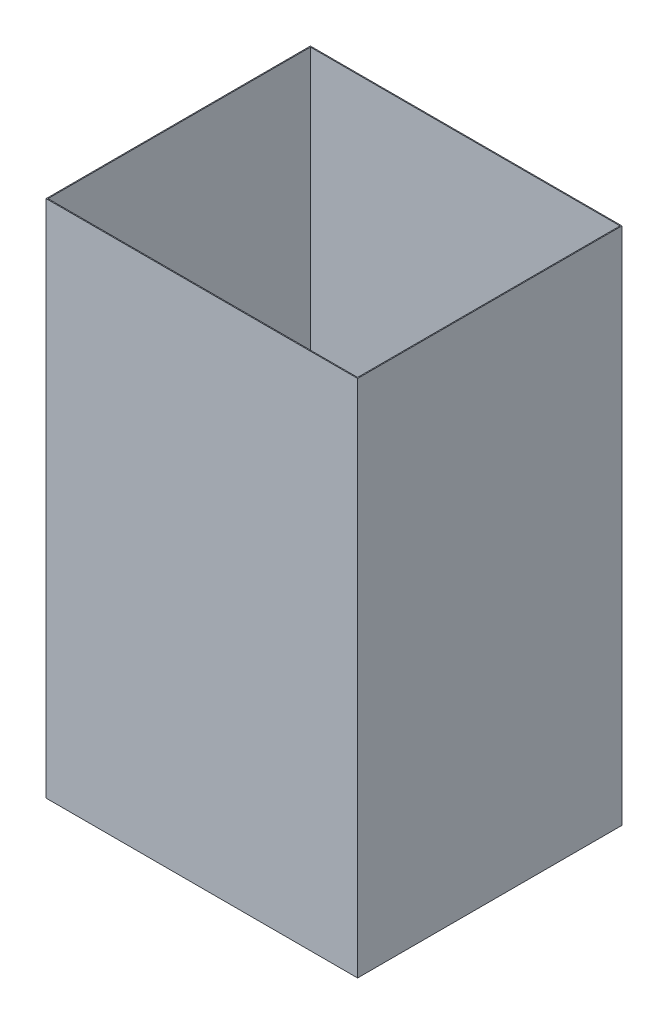
ISO-10303-21;
HEADER;
FILE_DESCRIPTION(('STEP AP214'),'2;1');
FILE_NAME('part.step','',(''),(''),'','','');
FILE_SCHEMA(('AUTOMOTIVE_DESIGN { 1 0 10303 214 1 1 1 1 }'));
ENDSEC;
DATA;
#1=APPLICATION_CONTEXT('core data for automotive mechanical design processes');
#2=APPLICATION_PROTOCOL_DEFINITION('international standard','automotive_design',2000,#1);
#3=PRODUCT_CONTEXT('',#1,'mechanical');
#4=PRODUCT('Part','Part','',(#3));
#5=PRODUCT_RELATED_PRODUCT_CATEGORY('part','',(#4));
#6=PRODUCT_DEFINITION_FORMATION('','',#4);
#7=PRODUCT_DEFINITION_CONTEXT('part definition',#1,'design');
#8=PRODUCT_DEFINITION('design','',#6,#7);
#9=PRODUCT_DEFINITION_SHAPE('','',#8);
#10=(LENGTH_UNIT() NAMED_UNIT(*) SI_UNIT(.MILLI.,.METRE.));
#11=(NAMED_UNIT(*) PLANE_ANGLE_UNIT() SI_UNIT($,.RADIAN.));
#12=(NAMED_UNIT(*) SI_UNIT($,.STERADIAN.) SOLID_ANGLE_UNIT());
#13=UNCERTAINTY_MEASURE_WITH_UNIT(LENGTH_MEASURE(1.E-05),#10,'distance_accuracy_value','');
#14=(GEOMETRIC_REPRESENTATION_CONTEXT(3) GLOBAL_UNCERTAINTY_ASSIGNED_CONTEXT((#13)) GLOBAL_UNIT_ASSIGNED_CONTEXT((#10,
#11,#12)) REPRESENTATION_CONTEXT('',''));
#15=CARTESIAN_POINT('',(0.,0.,0.));
#16=DIRECTION('',(0.,0.,1.));
#17=DIRECTION('',(1.,0.,0.));
#18=AXIS2_PLACEMENT_3D('',#15,#16,#17);
#19=CARTESIAN_POINT('',(0.,0.,0.));
#20=DIRECTION('',(0.,-1.,0.));
#21=DIRECTION('',(0.,0.,-1.));
#22=AXIS2_PLACEMENT_3D('',#19,#20,#21);
#23=PLANE('',#22);
#24=DIRECTION('',(0.,0.,1.));
#25=VECTOR('',#24,1.);
#26=CARTESIAN_POINT('',(0.,0.,0.));
#27=LINE('',#26,#25);
#28=CARTESIAN_POINT('',(0.,0.,-711.2));
#29=VERTEX_POINT('',#28);
#30=CARTESIAN_POINT('',(0.,0.,0.));
#31=VERTEX_POINT('',#30);
#32=EDGE_CURVE('E107',#29,#31,#27,.T.);
#33=ORIENTED_EDGE('',*,*,#32,.F.);
#34=DIRECTION('',(-1.,0.,0.));
#35=VECTOR('',#34,1.);
#36=CARTESIAN_POINT('',(0.,0.,-711.2));
#37=LINE('',#36,#35);
#38=CARTESIAN_POINT('',(838.2,0.,-711.2));
#39=VERTEX_POINT('',#38);
#40=EDGE_CURVE('E140',#39,#29,#37,.T.);
#41=ORIENTED_EDGE('',*,*,#40,.F.);
#42=DIRECTION('',(0.,0.,-1.));
#43=VECTOR('',#42,1.);
#44=CARTESIAN_POINT('',(838.2,0.,0.));
#45=LINE('',#44,#43);
#46=CARTESIAN_POINT('',(838.2,0.,0.));
#47=VERTEX_POINT('',#46);
#48=EDGE_CURVE('E151',#47,#39,#45,.T.);
#49=ORIENTED_EDGE('',*,*,#48,.F.);
#50=DIRECTION('',(1.,0.,0.));
#51=VECTOR('',#50,1.);
#52=CARTESIAN_POINT('',(0.,0.,0.));
#53=LINE('',#52,#51);
#54=EDGE_CURVE('E149',#31,#47,#53,.T.);
#55=ORIENTED_EDGE('',*,*,#54,.F.);
#56=EDGE_LOOP('',(#33,#41,#49,#55));
#57=FACE_BOUND('',#56,.T.);
#58=DIRECTION('',(-1.,0.,0.));
#59=VECTOR('',#58,1.);
#60=CARTESIAN_POINT('',(0.,0.,-708.66));
#61=LINE('',#60,#59);
#62=CARTESIAN_POINT('',(835.66,0.,-708.66));
#63=VERTEX_POINT('',#62);
#64=CARTESIAN_POINT('',(2.54,0.,-708.66));
#65=VERTEX_POINT('',#64);
#66=EDGE_CURVE('E128',#63,#65,#61,.T.);
#67=ORIENTED_EDGE('',*,*,#66,.T.);
#68=DIRECTION('',(0.,0.,1.));
#69=VECTOR('',#68,1.);
#70=CARTESIAN_POINT('',(2.54,0.,0.));
#71=LINE('',#70,#69);
#72=CARTESIAN_POINT('',(2.54,0.,-2.54));
#73=VERTEX_POINT('',#72);
#74=EDGE_CURVE('E115',#65,#73,#71,.T.);
#75=ORIENTED_EDGE('',*,*,#74,.T.);
#76=DIRECTION('',(1.,0.,0.));
#77=VECTOR('',#76,1.);
#78=CARTESIAN_POINT('',(0.,0.,-2.54));
#79=LINE('',#78,#77);
#80=CARTESIAN_POINT('',(835.66,0.,-2.54));
#81=VERTEX_POINT('',#80);
#82=EDGE_CURVE('E105',#73,#81,#79,.T.);
#83=ORIENTED_EDGE('',*,*,#82,.T.);
#84=DIRECTION('',(0.,0.,-1.));
#85=VECTOR('',#84,1.);
#86=CARTESIAN_POINT('',(835.66,0.,0.));
#87=LINE('',#86,#85);
#88=EDGE_CURVE('E56',#81,#63,#87,.T.);
#89=ORIENTED_EDGE('',*,*,#88,.T.);
#90=EDGE_LOOP('',(#67,#75,#83,#89));
#91=FACE_BOUND('',#90,.T.);
#92=ADVANCED_FACE('F33',(#57,#91),#23,.T.);
#93=CARTESIAN_POINT('',(0.,1397.,0.));
#94=DIRECTION('',(1.,0.,0.));
#95=DIRECTION('',(0.,0.,-1.));
#96=AXIS2_PLACEMENT_3D('',#93,#94,#95);
#97=PLANE('',#96);
#98=ORIENTED_EDGE('',*,*,#32,.T.);
#99=DIRECTION('',(0.,-1.,0.));
#100=VECTOR('',#99,1.);
#101=CARTESIAN_POINT('',(0.,1397.,0.));
#102=LINE('',#101,#100);
#103=CARTESIAN_POINT('',(0.,1397.,0.));
#104=VERTEX_POINT('',#103);
#105=EDGE_CURVE('E11',#104,#31,#102,.T.);
#106=ORIENTED_EDGE('',*,*,#105,.F.);
#107=DIRECTION('',(0.,0.,1.));
#108=VECTOR('',#107,1.);
#109=CARTESIAN_POINT('',(0.,1397.,0.));
#110=LINE('',#109,#108);
#111=CARTESIAN_POINT('',(0.,1397.,-711.2));
#112=VERTEX_POINT('',#111);
#113=EDGE_CURVE('E136',#112,#104,#110,.T.);
#114=ORIENTED_EDGE('',*,*,#113,.F.);
#115=DIRECTION('',(0.,-1.,0.));
#116=VECTOR('',#115,1.);
#117=CARTESIAN_POINT('',(0.,1397.,-711.2));
#118=LINE('',#117,#116);
#119=EDGE_CURVE('E146',#112,#29,#118,.T.);
#120=ORIENTED_EDGE('',*,*,#119,.T.);
#121=EDGE_LOOP('',(#98,#106,#114,#120));
#122=FACE_BOUND('',#121,.T.);
#123=ADVANCED_FACE('F35',(#122),#97,.F.);
#124=CARTESIAN_POINT('',(0.,1397.,0.));
#125=DIRECTION('',(0.,0.,-1.));
#126=DIRECTION('',(-1.,0.,0.));
#127=AXIS2_PLACEMENT_3D('',#124,#125,#126);
#128=PLANE('',#127);
#129=ORIENTED_EDGE('',*,*,#54,.T.);
#130=DIRECTION('',(0.,-1.,0.));
#131=VECTOR('',#130,1.);
#132=CARTESIAN_POINT('',(838.2,1397.,0.));
#133=LINE('',#132,#131);
#134=CARTESIAN_POINT('',(838.2,1397.,0.));
#135=VERTEX_POINT('',#134);
#136=EDGE_CURVE('E41',#135,#47,#133,.T.);
#137=ORIENTED_EDGE('',*,*,#136,.F.);
#138=DIRECTION('',(1.,0.,0.));
#139=VECTOR('',#138,1.);
#140=CARTESIAN_POINT('',(0.,1397.,0.));
#141=LINE('',#140,#139);
#142=EDGE_CURVE('E139',#104,#135,#141,.T.);
#143=ORIENTED_EDGE('',*,*,#142,.F.);
#144=ORIENTED_EDGE('',*,*,#105,.T.);
#145=EDGE_LOOP('',(#129,#137,#143,#144));
#146=FACE_BOUND('',#145,.T.);
#147=ADVANCED_FACE('F177',(#146),#128,.F.);
#148=CARTESIAN_POINT('',(838.2,1397.,0.));
#149=DIRECTION('',(-1.,0.,0.));
#150=DIRECTION('',(0.,0.,1.));
#151=AXIS2_PLACEMENT_3D('',#148,#149,#150);
#152=PLANE('',#151);
#153=ORIENTED_EDGE('',*,*,#48,.T.);
#154=DIRECTION('',(0.,-1.,0.));
#155=VECTOR('',#154,1.);
#156=CARTESIAN_POINT('',(838.2,1397.,-711.2));
#157=LINE('',#156,#155);
#158=CARTESIAN_POINT('',(838.2,1397.,-711.2));
#159=VERTEX_POINT('',#158);
#160=EDGE_CURVE('E156',#159,#39,#157,.T.);
#161=ORIENTED_EDGE('',*,*,#160,.F.);
#162=DIRECTION('',(0.,0.,-1.));
#163=VECTOR('',#162,1.);
#164=CARTESIAN_POINT('',(838.2,1397.,0.));
#165=LINE('',#164,#163);
#166=EDGE_CURVE('E142',#135,#159,#165,.T.);
#167=ORIENTED_EDGE('',*,*,#166,.F.);
#168=ORIENTED_EDGE('',*,*,#136,.T.);
#169=EDGE_LOOP('',(#153,#161,#167,#168));
#170=FACE_BOUND('',#169,.T.);
#171=ADVANCED_FACE('F163',(#170),#152,.F.);
#172=CARTESIAN_POINT('',(0.,1397.,-711.2));
#173=DIRECTION('',(0.,0.,1.));
#174=DIRECTION('',(1.,0.,0.));
#175=AXIS2_PLACEMENT_3D('',#172,#173,#174);
#176=PLANE('',#175);
#177=ORIENTED_EDGE('',*,*,#40,.T.);
#178=ORIENTED_EDGE('',*,*,#119,.F.);
#179=DIRECTION('',(-1.,0.,0.));
#180=VECTOR('',#179,1.);
#181=CARTESIAN_POINT('',(0.,1397.,-711.2));
#182=LINE('',#181,#180);
#183=EDGE_CURVE('E144',#159,#112,#182,.T.);
#184=ORIENTED_EDGE('',*,*,#183,.F.);
#185=ORIENTED_EDGE('',*,*,#160,.T.);
#186=EDGE_LOOP('',(#177,#178,#184,#185));
#187=FACE_BOUND('',#186,.T.);
#188=ADVANCED_FACE('F172',(#187),#176,.F.);
#189=CARTESIAN_POINT('',(0.,1397.,0.));
#190=DIRECTION('',(0.,-1.,0.));
#191=DIRECTION('',(0.,0.,-1.));
#192=AXIS2_PLACEMENT_3D('',#189,#190,#191);
#193=PLANE('',#192);
#194=DIRECTION('',(0.,0.,-1.));
#195=VECTOR('',#194,1.);
#196=CARTESIAN_POINT('',(835.66,1397.,-708.66));
#197=LINE('',#196,#195);
#198=CARTESIAN_POINT('',(835.66,1397.,-2.54));
#199=VERTEX_POINT('',#198);
#200=CARTESIAN_POINT('',(835.66,1397.,-708.66));
#201=VERTEX_POINT('',#200);
#202=EDGE_CURVE('E120',#199,#201,#197,.T.);
#203=ORIENTED_EDGE('',*,*,#202,.F.);
#204=DIRECTION('',(1.,0.,0.));
#205=VECTOR('',#204,1.);
#206=CARTESIAN_POINT('',(835.66,1397.,-2.54));
#207=LINE('',#206,#205);
#208=CARTESIAN_POINT('',(2.54,1397.,-2.54));
#209=VERTEX_POINT('',#208);
#210=EDGE_CURVE('E102',#209,#199,#207,.T.);
#211=ORIENTED_EDGE('',*,*,#210,.F.);
#212=DIRECTION('',(0.,0.,1.));
#213=VECTOR('',#212,1.);
#214=CARTESIAN_POINT('',(2.54,1397.,-2.54));
#215=LINE('',#214,#213);
#216=CARTESIAN_POINT('',(2.54,1397.,-708.66));
#217=VERTEX_POINT('',#216);
#218=EDGE_CURVE('E111',#217,#209,#215,.T.);
#219=ORIENTED_EDGE('',*,*,#218,.F.);
#220=DIRECTION('',(-1.,0.,0.));
#221=VECTOR('',#220,1.);
#222=CARTESIAN_POINT('',(2.54,1397.,-708.66));
#223=LINE('',#222,#221);
#224=EDGE_CURVE('E122',#201,#217,#223,.T.);
#225=ORIENTED_EDGE('',*,*,#224,.F.);
#226=EDGE_LOOP('',(#203,#211,#219,#225));
#227=FACE_BOUND('',#226,.T.);
#228=ORIENTED_EDGE('',*,*,#113,.T.);
#229=ORIENTED_EDGE('',*,*,#142,.T.);
#230=ORIENTED_EDGE('',*,*,#166,.T.);
#231=ORIENTED_EDGE('',*,*,#183,.T.);
#232=EDGE_LOOP('',(#228,#229,#230,#231));
#233=FACE_BOUND('',#232,.T.);
#234=ADVANCED_FACE('F117',(#227,#233),#193,.F.);
#235=CARTESIAN_POINT('',(2.54,1397.,0.));
#236=DIRECTION('',(1.,0.,0.));
#237=DIRECTION('',(0.,0.,-1.));
#238=AXIS2_PLACEMENT_3D('',#235,#236,#237);
#239=PLANE('',#238);
#240=ORIENTED_EDGE('',*,*,#74,.F.);
#241=DIRECTION('',(0.,-1.,0.));
#242=VECTOR('',#241,1.);
#243=CARTESIAN_POINT('',(2.54,1397.,-708.66));
#244=LINE('',#243,#242);
#245=EDGE_CURVE('E48',#217,#65,#244,.T.);
#246=ORIENTED_EDGE('',*,*,#245,.F.);
#247=ORIENTED_EDGE('',*,*,#218,.T.);
#248=DIRECTION('',(0.,-1.,0.));
#249=VECTOR('',#248,1.);
#250=CARTESIAN_POINT('',(2.54,1397.,-2.54));
#251=LINE('',#250,#249);
#252=EDGE_CURVE('E99',#209,#73,#251,.T.);
#253=ORIENTED_EDGE('',*,*,#252,.T.);
#254=EDGE_LOOP('',(#240,#246,#247,#253));
#255=FACE_BOUND('',#254,.T.);
#256=ADVANCED_FACE('F112',(#255),#239,.T.);
#257=CARTESIAN_POINT('',(0.,1397.,-2.54));
#258=DIRECTION('',(0.,0.,-1.));
#259=DIRECTION('',(-1.,0.,0.));
#260=AXIS2_PLACEMENT_3D('',#257,#258,#259);
#261=PLANE('',#260);
#262=ORIENTED_EDGE('',*,*,#82,.F.);
#263=ORIENTED_EDGE('',*,*,#252,.F.);
#264=ORIENTED_EDGE('',*,*,#210,.T.);
#265=DIRECTION('',(0.,-1.,0.));
#266=VECTOR('',#265,1.);
#267=CARTESIAN_POINT('',(835.66,1397.,-2.54));
#268=LINE('',#267,#266);
#269=EDGE_CURVE('E108',#199,#81,#268,.T.);
#270=ORIENTED_EDGE('',*,*,#269,.T.);
#271=EDGE_LOOP('',(#262,#263,#264,#270));
#272=FACE_BOUND('',#271,.T.);
#273=ADVANCED_FACE('F100',(#272),#261,.T.);
#274=CARTESIAN_POINT('',(835.66,1397.,0.));
#275=DIRECTION('',(-1.,0.,0.));
#276=DIRECTION('',(0.,0.,1.));
#277=AXIS2_PLACEMENT_3D('',#274,#275,#276);
#278=PLANE('',#277);
#279=ORIENTED_EDGE('',*,*,#88,.F.);
#280=ORIENTED_EDGE('',*,*,#269,.F.);
#281=ORIENTED_EDGE('',*,*,#202,.T.);
#282=DIRECTION('',(0.,-1.,0.));
#283=VECTOR('',#282,1.);
#284=CARTESIAN_POINT('',(835.66,1397.,-708.66));
#285=LINE('',#284,#283);
#286=EDGE_CURVE('E127',#201,#63,#285,.T.);
#287=ORIENTED_EDGE('',*,*,#286,.T.);
#288=EDGE_LOOP('',(#279,#280,#281,#287));
#289=FACE_BOUND('',#288,.T.);
#290=ADVANCED_FACE('F202',(#289),#278,.T.);
#291=CARTESIAN_POINT('',(0.,1397.,-708.66));
#292=DIRECTION('',(0.,0.,1.));
#293=DIRECTION('',(1.,0.,0.));
#294=AXIS2_PLACEMENT_3D('',#291,#292,#293);
#295=PLANE('',#294);
#296=ORIENTED_EDGE('',*,*,#66,.F.);
#297=ORIENTED_EDGE('',*,*,#286,.F.);
#298=ORIENTED_EDGE('',*,*,#224,.T.);
#299=ORIENTED_EDGE('',*,*,#245,.T.);
#300=EDGE_LOOP('',(#296,#297,#298,#299));
#301=FACE_BOUND('',#300,.T.);
#302=ADVANCED_FACE('F206',(#301),#295,.T.);
#303=CLOSED_SHELL('',(#92,#123,#147,#171,#188,#234,#256,#273,#290,#302));
#304=MANIFOLD_SOLID_BREP('B2',#303);
#305=ADVANCED_BREP_SHAPE_REPRESENTATION('',(#18,#304),#14);
#306=SHAPE_DEFINITION_REPRESENTATION(#9,#305);
ENDSEC;
END-ISO-10303-21;
